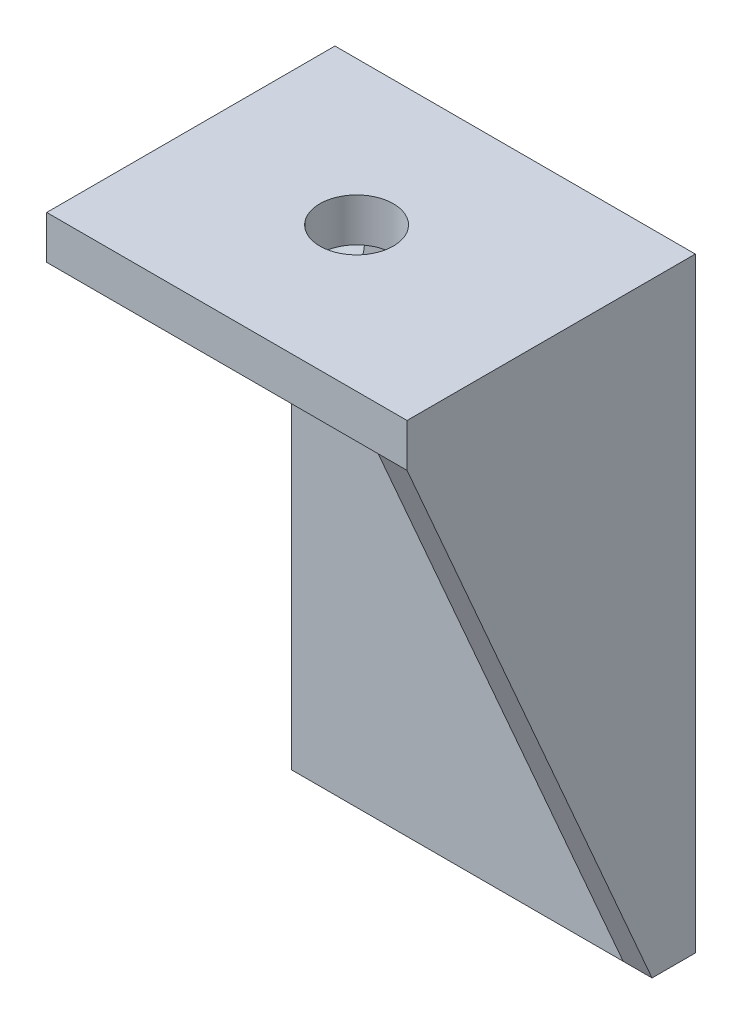
ISO-10303-21;
HEADER;
FILE_DESCRIPTION(('STEP AP214'),'2;1');
FILE_NAME('part.step','',(''),(''),'','','');
FILE_SCHEMA(('AUTOMOTIVE_DESIGN { 1 0 10303 214 1 1 1 1 }'));
ENDSEC;
DATA;
#1=APPLICATION_CONTEXT('core data for automotive mechanical design processes');
#2=APPLICATION_PROTOCOL_DEFINITION('international standard','automotive_design',2000,#1);
#3=PRODUCT_CONTEXT('',#1,'mechanical');
#4=PRODUCT('Part','Part','',(#3));
#5=PRODUCT_RELATED_PRODUCT_CATEGORY('part','',(#4));
#6=PRODUCT_DEFINITION_FORMATION('','',#4);
#7=PRODUCT_DEFINITION_CONTEXT('part definition',#1,'design');
#8=PRODUCT_DEFINITION('design','',#6,#7);
#9=PRODUCT_DEFINITION_SHAPE('','',#8);
#10=(LENGTH_UNIT() NAMED_UNIT(*) SI_UNIT(.MILLI.,.METRE.));
#11=(NAMED_UNIT(*) PLANE_ANGLE_UNIT() SI_UNIT($,.RADIAN.));
#12=(NAMED_UNIT(*) SI_UNIT($,.STERADIAN.) SOLID_ANGLE_UNIT());
#13=UNCERTAINTY_MEASURE_WITH_UNIT(LENGTH_MEASURE(1.E-05),#10,'distance_accuracy_value','');
#14=(GEOMETRIC_REPRESENTATION_CONTEXT(3) GLOBAL_UNCERTAINTY_ASSIGNED_CONTEXT((#13)) GLOBAL_UNIT_ASSIGNED_CONTEXT((#10,
#11,#12)) REPRESENTATION_CONTEXT('',''));
#15=CARTESIAN_POINT('',(0.,0.,0.));
#16=DIRECTION('',(0.,0.,1.));
#17=DIRECTION('',(1.,0.,0.));
#18=AXIS2_PLACEMENT_3D('',#15,#16,#17);
#19=CARTESIAN_POINT('',(0.,0.,3.));
#20=DIRECTION('',(0.,0.,-1.));
#21=DIRECTION('',(-1.,0.,0.));
#22=AXIS2_PLACEMENT_3D('',#19,#20,#21);
#23=PLANE('',#22);
#24=DIRECTION('',(0.,1.,0.));
#25=VECTOR('',#24,1.);
#26=CARTESIAN_POINT('',(23.,0.,3.));
#27=LINE('',#26,#25);
#28=CARTESIAN_POINT('',(23.,0.,3.));
#29=VERTEX_POINT('',#28);
#30=CARTESIAN_POINT('',(23.,39.0000000740001,3.));
#31=VERTEX_POINT('',#30);
#32=EDGE_CURVE('E209',#29,#31,#27,.T.);
#33=ORIENTED_EDGE('',*,*,#32,.T.);
#34=DIRECTION('',(-1.,0.,0.));
#35=VECTOR('',#34,1.);
#36=CARTESIAN_POINT('',(0.,39.0000000740001,3.));
#37=LINE('',#36,#35);
#38=CARTESIAN_POINT('',(0.,39.0000000740001,3.));
#39=VERTEX_POINT('',#38);
#40=EDGE_CURVE('E177',#31,#39,#37,.T.);
#41=ORIENTED_EDGE('',*,*,#40,.T.);
#42=DIRECTION('',(0.,-1.,0.));
#43=VECTOR('',#42,1.);
#44=CARTESIAN_POINT('',(0.,0.,3.));
#45=LINE('',#44,#43);
#46=CARTESIAN_POINT('',(0.,0.,3.));
#47=VERTEX_POINT('',#46);
#48=EDGE_CURVE('E80',#39,#47,#45,.T.);
#49=ORIENTED_EDGE('',*,*,#48,.T.);
#50=DIRECTION('',(1.,0.,0.));
#51=VECTOR('',#50,1.);
#52=CARTESIAN_POINT('',(0.,0.,3.));
#53=LINE('',#52,#51);
#54=EDGE_CURVE('E205',#47,#29,#53,.T.);
#55=ORIENTED_EDGE('',*,*,#54,.T.);
#56=EDGE_LOOP('',(#33,#41,#49,#55));
#57=FACE_BOUND('',#56,.T.);
#58=CARTESIAN_POINT('',(17.34,12.13,3.));
#59=DIRECTION('',(0.,0.,1.));
#60=DIRECTION('',(1.,0.,0.));
#61=AXIS2_PLACEMENT_3D('',#58,#59,#60);
#62=CIRCLE('',#61,2.05);
#63=CARTESIAN_POINT('',(19.39,12.13,3.));
#64=VERTEX_POINT('',#63);
#65=EDGE_CURVE('E195',#64,#64,#62,.T.);
#66=ORIENTED_EDGE('',*,*,#65,.F.);
#67=EDGE_LOOP('',(#66));
#68=FACE_BOUND('',#67,.T.);
#69=CARTESIAN_POINT('',(2.99,34.1,3.));
#70=DIRECTION('',(0.,0.,1.));
#71=DIRECTION('',(1.,0.,0.));
#72=AXIS2_PLACEMENT_3D('',#69,#70,#71);
#73=CIRCLE('',#72,2.05);
#74=CARTESIAN_POINT('',(5.04000000000001,34.1,3.));
#75=VERTEX_POINT('',#74);
#76=EDGE_CURVE('E187',#75,#75,#73,.T.);
#77=ORIENTED_EDGE('',*,*,#76,.F.);
#78=EDGE_LOOP('',(#77));
#79=FACE_BOUND('',#78,.T.);
#80=ADVANCED_FACE('F56',(#57,#68,#79),#23,.F.);
#81=CARTESIAN_POINT('',(0.,0.,0.));
#82=DIRECTION('',(0.,0.,-1.));
#83=DIRECTION('',(-1.,0.,0.));
#84=AXIS2_PLACEMENT_3D('',#81,#82,#83);
#85=PLANE('',#84);
#86=CARTESIAN_POINT('',(17.34,12.13,0.));
#87=DIRECTION('',(0.,0.,1.));
#88=DIRECTION('',(1.,0.,0.));
#89=AXIS2_PLACEMENT_3D('',#86,#87,#88);
#90=CIRCLE('',#89,2.05);
#91=CARTESIAN_POINT('',(19.39,12.13,0.));
#92=VERTEX_POINT('',#91);
#93=EDGE_CURVE('E191',#92,#92,#90,.T.);
#94=ORIENTED_EDGE('',*,*,#93,.T.);
#95=EDGE_LOOP('',(#94));
#96=FACE_BOUND('',#95,.T.);
#97=DIRECTION('',(0.,-1.,0.));
#98=VECTOR('',#97,1.);
#99=CARTESIAN_POINT('',(0.,0.,0.));
#100=LINE('',#99,#98);
#101=CARTESIAN_POINT('',(0.,42.000000074,0.));
#102=VERTEX_POINT('',#101);
#103=CARTESIAN_POINT('',(0.,0.,0.));
#104=VERTEX_POINT('',#103);
#105=EDGE_CURVE('E199',#102,#104,#100,.T.);
#106=ORIENTED_EDGE('',*,*,#105,.F.);
#107=DIRECTION('',(-1.,0.,0.));
#108=VECTOR('',#107,1.);
#109=CARTESIAN_POINT('',(0.,42.000000074,0.));
#110=LINE('',#109,#108);
#111=CARTESIAN_POINT('',(25.,42.000000074,0.));
#112=VERTEX_POINT('',#111);
#113=EDGE_CURVE('E206',#112,#102,#110,.T.);
#114=ORIENTED_EDGE('',*,*,#113,.F.);
#115=DIRECTION('',(0.,1.,0.));
#116=VECTOR('',#115,1.);
#117=CARTESIAN_POINT('',(25.,0.,0.));
#118=LINE('',#117,#116);
#119=CARTESIAN_POINT('',(25.,0.,0.));
#120=VERTEX_POINT('',#119);
#121=EDGE_CURVE('E229',#120,#112,#118,.T.);
#122=ORIENTED_EDGE('',*,*,#121,.F.);
#123=DIRECTION('',(1.,0.,0.));
#124=VECTOR('',#123,1.);
#125=CARTESIAN_POINT('',(0.,0.,0.));
#126=LINE('',#125,#124);
#127=EDGE_CURVE('E94',#104,#120,#126,.T.);
#128=ORIENTED_EDGE('',*,*,#127,.F.);
#129=EDGE_LOOP('',(#106,#114,#122,#128));
#130=FACE_BOUND('',#129,.T.);
#131=CARTESIAN_POINT('',(2.99,34.1,0.));
#132=DIRECTION('',(0.,0.,1.));
#133=DIRECTION('',(1.,0.,0.));
#134=AXIS2_PLACEMENT_3D('',#131,#132,#133);
#135=CIRCLE('',#134,2.05);
#136=CARTESIAN_POINT('',(5.04000000000001,34.1,0.));
#137=VERTEX_POINT('',#136);
#138=EDGE_CURVE('E186',#137,#137,#135,.T.);
#139=ORIENTED_EDGE('',*,*,#138,.T.);
#140=EDGE_LOOP('',(#139));
#141=FACE_BOUND('',#140,.T.);
#142=ADVANCED_FACE('F227',(#96,#130,#141),#85,.T.);
#143=CARTESIAN_POINT('',(0.,0.,3.));
#144=DIRECTION('',(1.,0.,0.));
#145=DIRECTION('',(0.,0.,-1.));
#146=AXIS2_PLACEMENT_3D('',#143,#144,#145);
#147=PLANE('',#146);
#148=ORIENTED_EDGE('',*,*,#105,.T.);
#149=DIRECTION('',(0.,0.,-1.));
#150=VECTOR('',#149,1.);
#151=CARTESIAN_POINT('',(0.,0.,3.));
#152=LINE('',#151,#150);
#153=EDGE_CURVE('E13',#47,#104,#152,.T.);
#154=ORIENTED_EDGE('',*,*,#153,.F.);
#155=ORIENTED_EDGE('',*,*,#48,.F.);
#156=DIRECTION('',(0.,0.,1.));
#157=VECTOR('',#156,1.);
#158=CARTESIAN_POINT('',(0.,39.0000000740001,3.));
#159=LINE('',#158,#157);
#160=CARTESIAN_POINT('',(0.,39.0000000740001,20.));
#161=VERTEX_POINT('',#160);
#162=EDGE_CURVE('E72',#39,#161,#159,.T.);
#163=ORIENTED_EDGE('',*,*,#162,.T.);
#164=DIRECTION('',(0.,1.,0.));
#165=VECTOR('',#164,1.);
#166=CARTESIAN_POINT('',(0.,39.0000000740001,20.));
#167=LINE('',#166,#165);
#168=CARTESIAN_POINT('',(0.,42.000000074,20.));
#169=VERTEX_POINT('',#168);
#170=EDGE_CURVE('E180',#161,#169,#167,.T.);
#171=ORIENTED_EDGE('',*,*,#170,.T.);
#172=DIRECTION('',(0.,0.,-1.));
#173=VECTOR('',#172,1.);
#174=CARTESIAN_POINT('',(0.,42.000000074,3.));
#175=LINE('',#174,#173);
#176=EDGE_CURVE('E65',#169,#102,#175,.T.);
#177=ORIENTED_EDGE('',*,*,#176,.T.);
#178=EDGE_LOOP('',(#148,#154,#155,#163,#171,#177));
#179=FACE_BOUND('',#178,.T.);
#180=ADVANCED_FACE('F58',(#179),#147,.F.);
#181=CARTESIAN_POINT('',(0.,0.,3.));
#182=DIRECTION('',(0.,1.,0.));
#183=DIRECTION('',(0.,0.,1.));
#184=AXIS2_PLACEMENT_3D('',#181,#182,#183);
#185=PLANE('',#184);
#186=ORIENTED_EDGE('',*,*,#127,.T.);
#187=DIRECTION('',(0.,0.,-1.));
#188=VECTOR('',#187,1.);
#189=CARTESIAN_POINT('',(25.,0.,3.));
#190=LINE('',#189,#188);
#191=CARTESIAN_POINT('',(25.,0.,3.));
#192=VERTEX_POINT('',#191);
#193=EDGE_CURVE('E137',#192,#120,#190,.T.);
#194=ORIENTED_EDGE('',*,*,#193,.F.);
#195=DIRECTION('',(-1.,0.,0.));
#196=VECTOR('',#195,1.);
#197=CARTESIAN_POINT('',(25.,0.,3.));
#198=LINE('',#197,#196);
#199=EDGE_CURVE('E132',#192,#29,#198,.T.);
#200=ORIENTED_EDGE('',*,*,#199,.T.);
#201=ORIENTED_EDGE('',*,*,#54,.F.);
#202=ORIENTED_EDGE('',*,*,#153,.T.);
#203=EDGE_LOOP('',(#186,#194,#200,#201,#202));
#204=FACE_BOUND('',#203,.T.);
#205=ADVANCED_FACE('F243',(#204),#185,.F.);
#206=CARTESIAN_POINT('',(0.,42.000000074,3.));
#207=DIRECTION('',(0.,-1.,0.));
#208=DIRECTION('',(0.,0.,-1.));
#209=AXIS2_PLACEMENT_3D('',#206,#207,#208);
#210=PLANE('',#209);
#211=ORIENTED_EDGE('',*,*,#113,.T.);
#212=ORIENTED_EDGE('',*,*,#176,.F.);
#213=DIRECTION('',(1.,0.,0.));
#214=VECTOR('',#213,1.);
#215=CARTESIAN_POINT('',(0.,42.000000074,20.));
#216=LINE('',#215,#214);
#217=CARTESIAN_POINT('',(25.,42.000000074,20.));
#218=VERTEX_POINT('',#217);
#219=EDGE_CURVE('E169',#169,#218,#216,.T.);
#220=ORIENTED_EDGE('',*,*,#219,.T.);
#221=DIRECTION('',(0.,0.,1.));
#222=VECTOR('',#221,1.);
#223=CARTESIAN_POINT('',(25.,42.000000074,20.));
#224=LINE('',#223,#222);
#225=EDGE_CURVE('E145',#112,#218,#224,.T.);
#226=ORIENTED_EDGE('',*,*,#225,.F.);
#227=EDGE_LOOP('',(#211,#212,#220,#226));
#228=FACE_BOUND('',#227,.T.);
#229=CARTESIAN_POINT('',(11.5,42.000000074,10.));
#230=DIRECTION('',(0.,1.,0.));
#231=DIRECTION('',(0.,0.,1.));
#232=AXIS2_PLACEMENT_3D('',#229,#230,#231);
#233=CIRCLE('',#232,2.55);
#234=CARTESIAN_POINT('',(11.5,42.000000074,12.55));
#235=VERTEX_POINT('',#234);
#236=EDGE_CURVE('E155',#235,#235,#233,.T.);
#237=ORIENTED_EDGE('',*,*,#236,.F.);
#238=EDGE_LOOP('',(#237));
#239=FACE_BOUND('',#238,.T.);
#240=ADVANCED_FACE('F232',(#228,#239),#210,.F.);
#241=CARTESIAN_POINT('',(17.34,12.13,3.));
#242=DIRECTION('',(0.,0.,-1.));
#243=DIRECTION('',(-1.,0.,0.));
#244=AXIS2_PLACEMENT_3D('',#241,#242,#243);
#245=CYLINDRICAL_SURFACE('',#244,2.05);
#246=ORIENTED_EDGE('',*,*,#65,.T.);
#247=EDGE_LOOP('',(#246));
#248=FACE_BOUND('',#247,.T.);
#249=ORIENTED_EDGE('',*,*,#93,.F.);
#250=EDGE_LOOP('',(#249));
#251=FACE_BOUND('',#250,.T.);
#252=ADVANCED_FACE('F261',(#248,#251),#245,.F.);
#253=CARTESIAN_POINT('',(2.99,34.1,3.));
#254=DIRECTION('',(0.,0.,-1.));
#255=DIRECTION('',(-1.,0.,0.));
#256=AXIS2_PLACEMENT_3D('',#253,#254,#255);
#257=CYLINDRICAL_SURFACE('',#256,2.05);
#258=ORIENTED_EDGE('',*,*,#76,.T.);
#259=EDGE_LOOP('',(#258));
#260=FACE_BOUND('',#259,.T.);
#261=ORIENTED_EDGE('',*,*,#138,.F.);
#262=EDGE_LOOP('',(#261));
#263=FACE_BOUND('',#262,.T.);
#264=ADVANCED_FACE('F304',(#260,#263),#257,.F.);
#265=CARTESIAN_POINT('',(0.,39.0000000740001,20.));
#266=DIRECTION('',(0.,0.,1.));
#267=DIRECTION('',(1.,0.,0.));
#268=AXIS2_PLACEMENT_3D('',#265,#266,#267);
#269=PLANE('',#268);
#270=ORIENTED_EDGE('',*,*,#219,.F.);
#271=ORIENTED_EDGE('',*,*,#170,.F.);
#272=DIRECTION('',(1.,0.,0.));
#273=VECTOR('',#272,1.);
#274=CARTESIAN_POINT('',(0.,39.0000000740001,20.));
#275=LINE('',#274,#273);
#276=CARTESIAN_POINT('',(23.,39.0000000740001,20.));
#277=VERTEX_POINT('',#276);
#278=EDGE_CURVE('E153',#161,#277,#275,.T.);
#279=ORIENTED_EDGE('',*,*,#278,.T.);
#280=DIRECTION('',(-1.,0.,0.));
#281=VECTOR('',#280,1.);
#282=CARTESIAN_POINT('',(25.,39.0000000740001,20.));
#283=LINE('',#282,#281);
#284=CARTESIAN_POINT('',(25.,39.0000000740001,20.));
#285=VERTEX_POINT('',#284);
#286=EDGE_CURVE('E130',#285,#277,#283,.T.);
#287=ORIENTED_EDGE('',*,*,#286,.F.);
#288=DIRECTION('',(0.,-1.,0.));
#289=VECTOR('',#288,1.);
#290=CARTESIAN_POINT('',(25.,39.0000000740001,20.));
#291=LINE('',#290,#289);
#292=EDGE_CURVE('E138',#218,#285,#291,.T.);
#293=ORIENTED_EDGE('',*,*,#292,.F.);
#294=EDGE_LOOP('',(#270,#271,#279,#287,#293));
#295=FACE_BOUND('',#294,.T.);
#296=ADVANCED_FACE('F152',(#295),#269,.T.);
#297=CARTESIAN_POINT('',(0.,39.0000000740001,0.));
#298=DIRECTION('',(0.,1.,0.));
#299=DIRECTION('',(0.,0.,1.));
#300=AXIS2_PLACEMENT_3D('',#297,#298,#299);
#301=PLANE('',#300);
#302=CARTESIAN_POINT('',(11.5,39.0000000740001,10.));
#303=DIRECTION('',(0.,1.,0.));
#304=DIRECTION('',(0.,0.,1.));
#305=AXIS2_PLACEMENT_3D('',#302,#303,#304);
#306=CIRCLE('',#305,2.55);
#307=CARTESIAN_POINT('',(11.5,39.0000000740001,12.55));
#308=VERTEX_POINT('',#307);
#309=EDGE_CURVE('E162',#308,#308,#306,.T.);
#310=ORIENTED_EDGE('',*,*,#309,.T.);
#311=EDGE_LOOP('',(#310));
#312=FACE_BOUND('',#311,.T.);
#313=ORIENTED_EDGE('',*,*,#162,.F.);
#314=ORIENTED_EDGE('',*,*,#40,.F.);
#315=DIRECTION('',(0.,0.,-1.));
#316=VECTOR('',#315,1.);
#317=CARTESIAN_POINT('',(23.,39.0000000740001,3.));
#318=LINE('',#317,#316);
#319=EDGE_CURVE('E101',#277,#31,#318,.T.);
#320=ORIENTED_EDGE('',*,*,#319,.F.);
#321=ORIENTED_EDGE('',*,*,#278,.F.);
#322=EDGE_LOOP('',(#313,#314,#320,#321));
#323=FACE_BOUND('',#322,.T.);
#324=ADVANCED_FACE('F303',(#312,#323),#301,.F.);
#325=CARTESIAN_POINT('',(11.5,39.0000000740001,10.));
#326=DIRECTION('',(0.,1.,0.));
#327=DIRECTION('',(0.,0.,1.));
#328=AXIS2_PLACEMENT_3D('',#325,#326,#327);
#329=CYLINDRICAL_SURFACE('',#328,2.55);
#330=ORIENTED_EDGE('',*,*,#309,.F.);
#331=EDGE_LOOP('',(#330));
#332=FACE_BOUND('',#331,.T.);
#333=ORIENTED_EDGE('',*,*,#236,.T.);
#334=EDGE_LOOP('',(#333));
#335=FACE_BOUND('',#334,.T.);
#336=ADVANCED_FACE('F316',(#332,#335),#329,.F.);
#337=CARTESIAN_POINT('',(25.,39.0000000740001,20.));
#338=DIRECTION('',(0.,0.399585419876799,-0.916695964986147));
#339=DIRECTION('',(0.,0.916695964986147,0.399585419876799));
#340=AXIS2_PLACEMENT_3D('',#337,#338,#339);
#341=PLANE('',#340);
#342=DIRECTION('',(0.,-0.916695964986147,-0.399585419876799));
#343=VECTOR('',#342,1.);
#344=CARTESIAN_POINT('',(23.,39.0000000740001,20.));
#345=LINE('',#344,#343);
#346=EDGE_CURVE('E149',#277,#29,#345,.T.);
#347=ORIENTED_EDGE('',*,*,#346,.T.);
#348=ORIENTED_EDGE('',*,*,#199,.F.);
#349=DIRECTION('',(0.,-0.916695964986147,-0.399585419876799));
#350=VECTOR('',#349,1.);
#351=CARTESIAN_POINT('',(25.,39.0000000740001,20.));
#352=LINE('',#351,#350);
#353=EDGE_CURVE('E125',#285,#192,#352,.T.);
#354=ORIENTED_EDGE('',*,*,#353,.F.);
#355=ORIENTED_EDGE('',*,*,#286,.T.);
#356=EDGE_LOOP('',(#347,#348,#354,#355));
#357=FACE_BOUND('',#356,.T.);
#358=ADVANCED_FACE('F128',(#357),#341,.F.);
#359=CARTESIAN_POINT('',(25.,0.,0.));
#360=DIRECTION('',(-1.,0.,0.));
#361=DIRECTION('',(0.,0.,1.));
#362=AXIS2_PLACEMENT_3D('',#359,#360,#361);
#363=PLANE('',#362);
#364=ORIENTED_EDGE('',*,*,#292,.T.);
#365=ORIENTED_EDGE('',*,*,#353,.T.);
#366=ORIENTED_EDGE('',*,*,#193,.T.);
#367=ORIENTED_EDGE('',*,*,#121,.T.);
#368=ORIENTED_EDGE('',*,*,#225,.T.);
#369=EDGE_LOOP('',(#364,#365,#366,#367,#368));
#370=FACE_BOUND('',#369,.T.);
#371=ADVANCED_FACE('F142',(#370),#363,.F.);
#372=CARTESIAN_POINT('',(23.,0.,0.));
#373=DIRECTION('',(-1.,0.,0.));
#374=DIRECTION('',(0.,0.,1.));
#375=AXIS2_PLACEMENT_3D('',#372,#373,#374);
#376=PLANE('',#375);
#377=ORIENTED_EDGE('',*,*,#346,.F.);
#378=ORIENTED_EDGE('',*,*,#319,.T.);
#379=ORIENTED_EDGE('',*,*,#32,.F.);
#380=EDGE_LOOP('',(#377,#378,#379));
#381=FACE_BOUND('',#380,.T.);
#382=ADVANCED_FACE('F245',(#381),#376,.T.);
#383=CLOSED_SHELL('',(#80,#142,#180,#205,#240,#252,#264,#296,#324,#336,#358,#371,#382));
#384=MANIFOLD_SOLID_BREP('B2',#383);
#385=ADVANCED_BREP_SHAPE_REPRESENTATION('',(#18,#384),#14);
#386=SHAPE_DEFINITION_REPRESENTATION(#9,#385);
ENDSEC;
END-ISO-10303-21;
